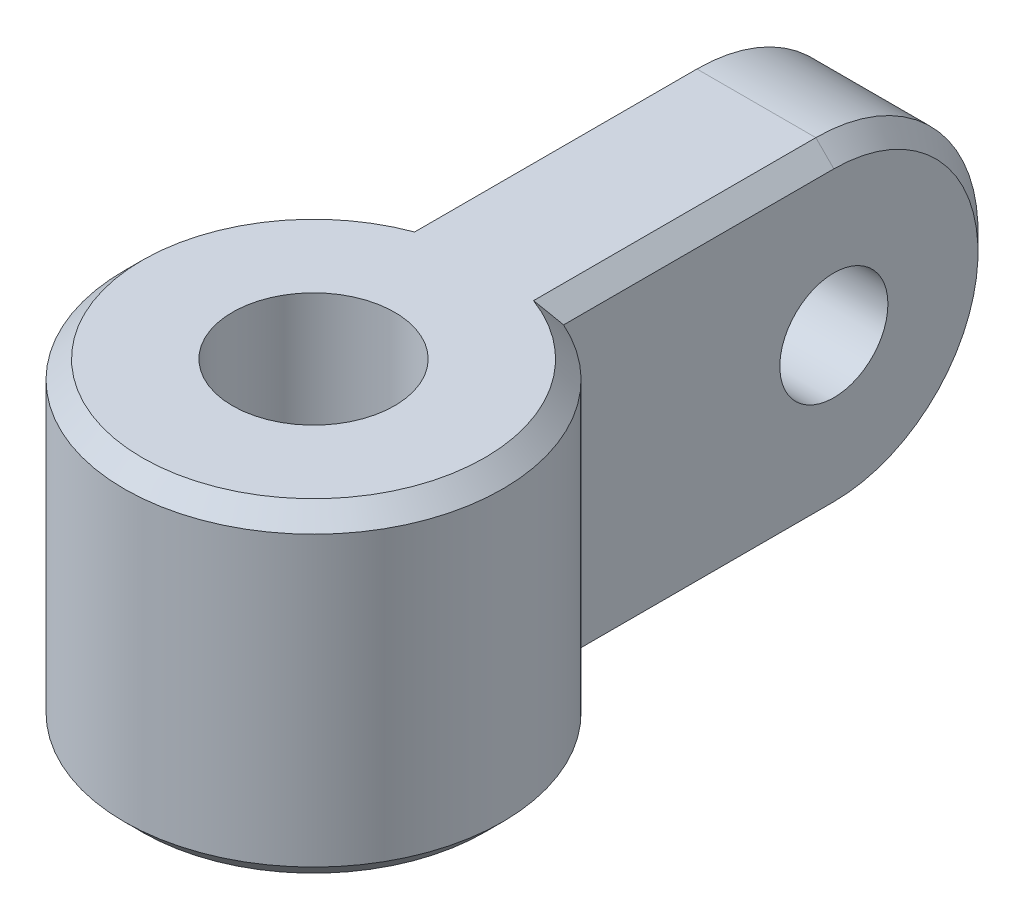
ISO-10303-21;
HEADER;
FILE_DESCRIPTION(('STEP AP214'),'2;1');
FILE_NAME('part.step','',(''),(''),'','','');
FILE_SCHEMA(('AUTOMOTIVE_DESIGN { 1 0 10303 214 1 1 1 1 }'));
ENDSEC;
DATA;
#1=APPLICATION_CONTEXT('core data for automotive mechanical design processes');
#2=APPLICATION_PROTOCOL_DEFINITION('international standard','automotive_design',2000,#1);
#3=PRODUCT_CONTEXT('',#1,'mechanical');
#4=PRODUCT('Part','Part','',(#3));
#5=PRODUCT_RELATED_PRODUCT_CATEGORY('part','',(#4));
#6=PRODUCT_DEFINITION_FORMATION('','',#4);
#7=PRODUCT_DEFINITION_CONTEXT('part definition',#1,'design');
#8=PRODUCT_DEFINITION('design','',#6,#7);
#9=PRODUCT_DEFINITION_SHAPE('','',#8);
#10=(LENGTH_UNIT() NAMED_UNIT(*) SI_UNIT(.MILLI.,.METRE.));
#11=(NAMED_UNIT(*) PLANE_ANGLE_UNIT() SI_UNIT($,.RADIAN.));
#12=(NAMED_UNIT(*) SI_UNIT($,.STERADIAN.) SOLID_ANGLE_UNIT());
#13=UNCERTAINTY_MEASURE_WITH_UNIT(LENGTH_MEASURE(1.E-05),#10,'distance_accuracy_value','');
#14=(GEOMETRIC_REPRESENTATION_CONTEXT(3) GLOBAL_UNCERTAINTY_ASSIGNED_CONTEXT((#13)) GLOBAL_UNIT_ASSIGNED_CONTEXT((#10,
#11,#12)) REPRESENTATION_CONTEXT('',''));
#15=CARTESIAN_POINT('',(0.,0.,0.));
#16=DIRECTION('',(0.,0.,1.));
#17=DIRECTION('',(1.,0.,0.));
#18=AXIS2_PLACEMENT_3D('',#15,#16,#17);
#19=CARTESIAN_POINT('',(0.,9.,0.));
#20=DIRECTION('',(0.,-1.,0.));
#21=DIRECTION('',(0.,0.,-1.));
#22=AXIS2_PLACEMENT_3D('',#19,#20,#21);
#23=CYLINDRICAL_SURFACE('',#22,5.25);
#24=DIRECTION('',(0.,-1.,0.));
#25=VECTOR('',#24,1.);
#26=CARTESIAN_POINT('',(-2.15,9.,-4.78957200593122));
#27=LINE('',#26,#25);
#28=CARTESIAN_POINT('',(-2.15,8.49999999999999,-4.78957200593122));
#29=VERTEX_POINT('',#28);
#30=CARTESIAN_POINT('',(-2.15,0.500000000000006,-4.78957200593122));
#31=VERTEX_POINT('',#30);
#32=EDGE_CURVE('E141',#29,#31,#27,.T.);
#33=ORIENTED_EDGE('',*,*,#32,.T.);
#34=CARTESIAN_POINT('',(0.,0.500000000000002,0.));
#35=DIRECTION('',(0.,1.,0.));
#36=DIRECTION('',(0.,0.,1.));
#37=AXIS2_PLACEMENT_3D('',#34,#35,#36);
#38=CIRCLE('',#37,5.25);
#39=CARTESIAN_POINT('',(2.15,0.500000000000006,-4.78957200593122));
#40=VERTEX_POINT('',#39);
#41=EDGE_CURVE('E139',#31,#40,#38,.T.);
#42=ORIENTED_EDGE('',*,*,#41,.T.);
#43=DIRECTION('',(0.,-1.,0.));
#44=VECTOR('',#43,1.);
#45=CARTESIAN_POINT('',(2.15,9.,-4.78957200593122));
#46=LINE('',#45,#44);
#47=CARTESIAN_POINT('',(2.15,8.49999999999999,-4.78957200593122));
#48=VERTEX_POINT('',#47);
#49=EDGE_CURVE('E122',#48,#40,#46,.T.);
#50=ORIENTED_EDGE('',*,*,#49,.F.);
#51=CARTESIAN_POINT('',(0.,8.49999999999999,0.));
#52=DIRECTION('',(0.,1.,0.));
#53=DIRECTION('',(0.,0.,1.));
#54=AXIS2_PLACEMENT_3D('',#51,#52,#53);
#55=CIRCLE('',#54,5.25);
#56=EDGE_CURVE('E136',#48,#29,#55,.F.);
#57=ORIENTED_EDGE('',*,*,#56,.T.);
#58=EDGE_LOOP('',(#33,#42,#50,#57));
#59=FACE_BOUND('',#58,.T.);
#60=ADVANCED_FACE('F47',(#59),#23,.T.);
#61=CARTESIAN_POINT('',(2.15,9.,0.));
#62=DIRECTION('',(-1.,0.,0.));
#63=DIRECTION('',(0.,0.,1.));
#64=AXIS2_PLACEMENT_3D('',#61,#62,#63);
#65=PLANE('',#64);
#66=ORIENTED_EDGE('',*,*,#49,.T.);
#67=DIRECTION('',(0.,0.,-1.));
#68=VECTOR('',#67,1.);
#69=CARTESIAN_POINT('',(2.15,0.500000000000006,0.));
#70=LINE('',#69,#68);
#71=CARTESIAN_POINT('',(2.15,0.500000000000004,-12.2895720059312));
#72=VERTEX_POINT('',#71);
#73=EDGE_CURVE('E273',#40,#72,#70,.T.);
#74=ORIENTED_EDGE('',*,*,#73,.T.);
#75=CARTESIAN_POINT('',(2.15,4.5,-12.2895720059312));
#76=DIRECTION('',(-1.,0.,0.));
#77=DIRECTION('',(0.,0.,1.));
#78=AXIS2_PLACEMENT_3D('',#75,#76,#77);
#79=CIRCLE('',#78,3.99999999999999);
#80=CARTESIAN_POINT('',(2.15,8.49999999999999,-12.2895720059312));
#81=VERTEX_POINT('',#80);
#82=EDGE_CURVE('E124',#72,#81,#79,.F.);
#83=ORIENTED_EDGE('',*,*,#82,.T.);
#84=DIRECTION('',(0.,0.,1.));
#85=VECTOR('',#84,1.);
#86=CARTESIAN_POINT('',(2.15,8.49999999999999,-4.78957200593122));
#87=LINE('',#86,#85);
#88=EDGE_CURVE('E118',#81,#48,#87,.T.);
#89=ORIENTED_EDGE('',*,*,#88,.T.);
#90=EDGE_LOOP('',(#66,#74,#83,#89));
#91=FACE_BOUND('',#90,.T.);
#92=CARTESIAN_POINT('',(2.15,4.5,-12.2895720059312));
#93=DIRECTION('',(1.,0.,0.));
#94=DIRECTION('',(0.,0.,-1.));
#95=AXIS2_PLACEMENT_3D('',#92,#93,#94);
#96=CIRCLE('',#95,1.5);
#97=CARTESIAN_POINT('',(2.15,4.5,-13.7895720059312));
#98=VERTEX_POINT('',#97);
#99=EDGE_CURVE('E326',#98,#98,#96,.T.);
#100=ORIENTED_EDGE('',*,*,#99,.F.);
#101=EDGE_LOOP('',(#100));
#102=FACE_BOUND('',#101,.T.);
#103=ADVANCED_FACE('F120',(#91,#102),#65,.F.);
#104=CARTESIAN_POINT('',(0.,9.,0.));
#105=DIRECTION('',(0.,-1.,0.));
#106=DIRECTION('',(0.,0.,-1.));
#107=AXIS2_PLACEMENT_3D('',#104,#105,#106);
#108=CYLINDRICAL_SURFACE('',#107,2.25);
#109=CARTESIAN_POINT('',(0.,9.,0.));
#110=DIRECTION('',(0.,1.,0.));
#111=DIRECTION('',(0.,0.,1.));
#112=AXIS2_PLACEMENT_3D('',#109,#110,#111);
#113=CIRCLE('',#112,2.25);
#114=CARTESIAN_POINT('',(0.,9.,2.25));
#115=VERTEX_POINT('',#114);
#116=EDGE_CURVE('E315',#115,#115,#113,.T.);
#117=ORIENTED_EDGE('',*,*,#116,.T.);
#118=EDGE_LOOP('',(#117));
#119=FACE_BOUND('',#118,.T.);
#120=CARTESIAN_POINT('',(0.,0.,0.));
#121=DIRECTION('',(0.,1.,0.));
#122=DIRECTION('',(0.,0.,1.));
#123=AXIS2_PLACEMENT_3D('',#120,#121,#122);
#124=CIRCLE('',#123,2.25);
#125=CARTESIAN_POINT('',(0.,0.,2.25));
#126=VERTEX_POINT('',#125);
#127=EDGE_CURVE('E316',#126,#126,#124,.T.);
#128=ORIENTED_EDGE('',*,*,#127,.F.);
#129=EDGE_LOOP('',(#128));
#130=FACE_BOUND('',#129,.T.);
#131=ADVANCED_FACE('F190',(#119,#130),#108,.F.);
#132=CARTESIAN_POINT('',(-2.15,9.,0.));
#133=DIRECTION('',(-1.,0.,0.));
#134=DIRECTION('',(0.,0.,1.));
#135=AXIS2_PLACEMENT_3D('',#132,#133,#134);
#136=PLANE('',#135);
#137=CARTESIAN_POINT('',(-2.15,4.5,-12.2895720059312));
#138=DIRECTION('',(-1.,0.,0.));
#139=DIRECTION('',(0.,0.,1.));
#140=AXIS2_PLACEMENT_3D('',#137,#138,#139);
#141=CIRCLE('',#140,3.99999999999999);
#142=CARTESIAN_POINT('',(-2.15,8.49999999999999,-12.2895720059312));
#143=VERTEX_POINT('',#142);
#144=CARTESIAN_POINT('',(-2.15,0.500000000000003,-12.2895720059312));
#145=VERTEX_POINT('',#144);
#146=EDGE_CURVE('E256',#143,#145,#141,.T.);
#147=ORIENTED_EDGE('',*,*,#146,.T.);
#148=DIRECTION('',(0.,0.,1.));
#149=VECTOR('',#148,1.);
#150=CARTESIAN_POINT('',(-2.15,0.500000000000006,-4.78957200593122));
#151=LINE('',#150,#149);
#152=EDGE_CURVE('E130',#145,#31,#151,.T.);
#153=ORIENTED_EDGE('',*,*,#152,.T.);
#154=ORIENTED_EDGE('',*,*,#32,.F.);
#155=DIRECTION('',(0.,0.,-1.));
#156=VECTOR('',#155,1.);
#157=CARTESIAN_POINT('',(-2.15,8.49999999999999,0.));
#158=LINE('',#157,#156);
#159=EDGE_CURVE('E257',#29,#143,#158,.T.);
#160=ORIENTED_EDGE('',*,*,#159,.T.);
#161=EDGE_LOOP('',(#147,#153,#154,#160));
#162=FACE_BOUND('',#161,.T.);
#163=CARTESIAN_POINT('',(-2.15,4.5,-12.2895720059312));
#164=DIRECTION('',(-1.,0.,0.));
#165=DIRECTION('',(0.,0.,1.));
#166=AXIS2_PLACEMENT_3D('',#163,#164,#165);
#167=CIRCLE('',#166,1.5);
#168=CARTESIAN_POINT('',(-2.15,4.5,-10.7895720059312));
#169=VERTEX_POINT('',#168);
#170=EDGE_CURVE('E320',#169,#169,#167,.F.);
#171=ORIENTED_EDGE('',*,*,#170,.T.);
#172=EDGE_LOOP('',(#171));
#173=FACE_BOUND('',#172,.T.);
#174=ADVANCED_FACE('F196',(#162,#173),#136,.T.);
#175=CARTESIAN_POINT('',(0.,9.,0.));
#176=DIRECTION('',(0.,1.,0.));
#177=DIRECTION('',(0.,0.,1.));
#178=AXIS2_PLACEMENT_3D('',#175,#176,#177);
#179=PLANE('',#178);
#180=DIRECTION('',(1.,0.,0.));
#181=VECTOR('',#180,1.);
#182=CARTESIAN_POINT('',(-14.8779220613579,9.,-12.2895720059312));
#183=LINE('',#182,#181);
#184=CARTESIAN_POINT('',(-1.65,9.,-12.2895720059312));
#185=VERTEX_POINT('',#184);
#186=CARTESIAN_POINT('',(1.65,9.,-12.2895720059312));
#187=VERTEX_POINT('',#186);
#188=EDGE_CURVE('E157',#185,#187,#183,.T.);
#189=ORIENTED_EDGE('',*,*,#188,.F.);
#190=DIRECTION('',(0.,0.,1.));
#191=VECTOR('',#190,1.);
#192=CARTESIAN_POINT('',(-1.65,9.,0.));
#193=LINE('',#192,#191);
#194=CARTESIAN_POINT('',(-1.64999999999998,9.,-4.45421149026402));
#195=VERTEX_POINT('',#194);
#196=EDGE_CURVE('E11',#185,#195,#193,.T.);
#197=ORIENTED_EDGE('',*,*,#196,.T.);
#198=CARTESIAN_POINT('',(0.,9.,0.));
#199=DIRECTION('',(0.,1.,0.));
#200=DIRECTION('',(0.,0.,1.));
#201=AXIS2_PLACEMENT_3D('',#198,#199,#200);
#202=CIRCLE('',#201,4.75);
#203=CARTESIAN_POINT('',(1.64999999999998,9.,-4.45421149026402));
#204=VERTEX_POINT('',#203);
#205=EDGE_CURVE('E70',#195,#204,#202,.T.);
#206=ORIENTED_EDGE('',*,*,#205,.T.);
#207=DIRECTION('',(0.,0.,-1.));
#208=VECTOR('',#207,1.);
#209=CARTESIAN_POINT('',(1.65,9.,-12.2895720059312));
#210=LINE('',#209,#208);
#211=EDGE_CURVE('E63',#204,#187,#210,.T.);
#212=ORIENTED_EDGE('',*,*,#211,.T.);
#213=EDGE_LOOP('',(#189,#197,#206,#212));
#214=FACE_BOUND('',#213,.T.);
#215=ORIENTED_EDGE('',*,*,#116,.F.);
#216=EDGE_LOOP('',(#215));
#217=FACE_BOUND('',#216,.T.);
#218=ADVANCED_FACE('F285',(#214,#217),#179,.T.);
#219=CARTESIAN_POINT('',(0.,0.,0.));
#220=DIRECTION('',(0.,1.,0.));
#221=DIRECTION('',(0.,0.,1.));
#222=AXIS2_PLACEMENT_3D('',#219,#220,#221);
#223=PLANE('',#222);
#224=ORIENTED_EDGE('',*,*,#127,.T.);
#225=EDGE_LOOP('',(#224));
#226=FACE_BOUND('',#225,.T.);
#227=CARTESIAN_POINT('',(0.,0.,0.));
#228=DIRECTION('',(0.,1.,0.));
#229=DIRECTION('',(0.,0.,1.));
#230=AXIS2_PLACEMENT_3D('',#227,#228,#229);
#231=CIRCLE('',#230,4.74999999999999);
#232=CARTESIAN_POINT('',(1.65,0.,-4.45421149026402));
#233=VERTEX_POINT('',#232);
#234=CARTESIAN_POINT('',(-1.64999999999998,0.,-4.45421149026402));
#235=VERTEX_POINT('',#234);
#236=EDGE_CURVE('E265',#233,#235,#231,.F.);
#237=ORIENTED_EDGE('',*,*,#236,.T.);
#238=DIRECTION('',(0.,0.,-1.));
#239=VECTOR('',#238,1.);
#240=CARTESIAN_POINT('',(-1.65,0.,-12.2895720059312));
#241=LINE('',#240,#239);
#242=CARTESIAN_POINT('',(-1.65,0.,-12.2895720059312));
#243=VERTEX_POINT('',#242);
#244=EDGE_CURVE('E260',#235,#243,#241,.T.);
#245=ORIENTED_EDGE('',*,*,#244,.T.);
#246=DIRECTION('',(1.,0.,0.));
#247=VECTOR('',#246,1.);
#248=CARTESIAN_POINT('',(-14.8779220613579,0.,-12.2895720059312));
#249=LINE('',#248,#247);
#250=CARTESIAN_POINT('',(1.65,0.,-12.2895720059312));
#251=VERTEX_POINT('',#250);
#252=EDGE_CURVE('E292',#243,#251,#249,.T.);
#253=ORIENTED_EDGE('',*,*,#252,.T.);
#254=DIRECTION('',(0.,0.,1.));
#255=VECTOR('',#254,1.);
#256=CARTESIAN_POINT('',(1.65,0.,0.));
#257=LINE('',#256,#255);
#258=EDGE_CURVE('E303',#251,#233,#257,.T.);
#259=ORIENTED_EDGE('',*,*,#258,.T.);
#260=EDGE_LOOP('',(#237,#245,#253,#259));
#261=FACE_BOUND('',#260,.T.);
#262=ADVANCED_FACE('F340',(#226,#261),#223,.F.);
#263=CARTESIAN_POINT('',(-14.8779220613579,4.5,-12.2895720059312));
#264=DIRECTION('',(1.,0.,0.));
#265=DIRECTION('',(0.,0.,-1.));
#266=AXIS2_PLACEMENT_3D('',#263,#264,#265);
#267=CYLINDRICAL_SURFACE('',#266,4.5);
#268=ORIENTED_EDGE('',*,*,#252,.F.);
#269=CARTESIAN_POINT('',(-1.65,4.5,-12.2895720059312));
#270=DIRECTION('',(-1.,0.,0.));
#271=DIRECTION('',(0.,0.,1.));
#272=AXIS2_PLACEMENT_3D('',#269,#270,#271);
#273=CIRCLE('',#272,4.5);
#274=EDGE_CURVE('E254',#243,#185,#273,.F.);
#275=ORIENTED_EDGE('',*,*,#274,.T.);
#276=ORIENTED_EDGE('',*,*,#188,.T.);
#277=CARTESIAN_POINT('',(1.65,4.5,-12.2895720059312));
#278=DIRECTION('',(-1.,0.,0.));
#279=DIRECTION('',(0.,0.,1.));
#280=AXIS2_PLACEMENT_3D('',#277,#278,#279);
#281=CIRCLE('',#280,4.5);
#282=EDGE_CURVE('E276',#187,#251,#281,.T.);
#283=ORIENTED_EDGE('',*,*,#282,.T.);
#284=EDGE_LOOP('',(#268,#275,#276,#283));
#285=FACE_BOUND('',#284,.T.);
#286=ADVANCED_FACE('F182',(#285),#267,.T.);
#287=CARTESIAN_POINT('',(-14.8779220613579,4.5,-12.2895720059312));
#288=DIRECTION('',(1.,0.,0.));
#289=DIRECTION('',(0.,0.,-1.));
#290=AXIS2_PLACEMENT_3D('',#287,#288,#289);
#291=CYLINDRICAL_SURFACE('',#290,1.5);
#292=ORIENTED_EDGE('',*,*,#99,.T.);
#293=EDGE_LOOP('',(#292));
#294=FACE_BOUND('',#293,.T.);
#295=ORIENTED_EDGE('',*,*,#170,.F.);
#296=EDGE_LOOP('',(#295));
#297=FACE_BOUND('',#296,.T.);
#298=ADVANCED_FACE('F175',(#294,#297),#291,.F.);
#299=CARTESIAN_POINT('',(0.,9.,0.));
#300=DIRECTION('',(0.,-1.,0.));
#301=DIRECTION('',(0.,0.,-1.));
#302=AXIS2_PLACEMENT_3D('',#299,#300,#301);
#303=CONICAL_SURFACE('',#302,4.75,0.785398163397445);
#304=CARTESIAN_POINT('',(2.15,8.49999999999999,-4.78957200593122));
#305=CARTESIAN_POINT('',(2.10806546686673,8.54193453313326,-4.76243009066161));
#306=CARTESIAN_POINT('',(2.06619245962986,8.58380754037014,-4.73509774494992));
#307=CARTESIAN_POINT('',(1.982579252243,8.66742074775699,-4.68003736977925));
#308=CARTESIAN_POINT('',(1.94083904564531,8.70916095435469,-4.65230935990042));
#309=CARTESIAN_POINT('',(1.85749680601256,8.79250319398743,-4.59643999125826));
#310=CARTESIAN_POINT('',(1.81589477381192,8.83410522618807,-4.56829863000432));
#311=CARTESIAN_POINT('',(1.73283583377882,8.91716416622118,-4.51158350224382));
#312=CARTESIAN_POINT('',(1.69137893320552,8.95862106679448,-4.48300971447825));
#313=CARTESIAN_POINT('',(1.64999999999984,9.00000000000015,-4.45421149026454));
#314=B_SPLINE_CURVE_WITH_KNOTS('',3,(#304,#305,#306,#307,#308,#309,#310,#311,#312,#313),
.UNSPECIFIED.,.F.,.F.,(4,2,2,2,4),(0.,0.195660893604835,0.391312137934826,0.586964561625966,
0.782626635458717),.UNSPECIFIED.);
#315=EDGE_CURVE('E146',#204,#48,#314,.F.);
#316=ORIENTED_EDGE('',*,*,#315,.F.);
#317=ORIENTED_EDGE('',*,*,#205,.F.);
#318=CARTESIAN_POINT('',(-1.65,9.,-4.45421149026406));
#319=CARTESIAN_POINT('',(-1.69137893320557,8.95862106679443,-4.48300971447808));
#320=CARTESIAN_POINT('',(-1.73283583377883,8.91716416622117,-4.51158350224377));
#321=CARTESIAN_POINT('',(-1.8158947738119,8.83410522618809,-4.56829863000437));
#322=CARTESIAN_POINT('',(-1.85749680601255,8.79250319398744,-4.59643999125827));
#323=CARTESIAN_POINT('',(-1.94083904564531,8.70916095435469,-4.65230935990041));
#324=CARTESIAN_POINT('',(-1.982579252243,8.66742074775699,-4.68003736977924));
#325=CARTESIAN_POINT('',(-2.06619245962985,8.58380754037014,-4.73509774494992));
#326=CARTESIAN_POINT('',(-2.10806546686673,8.54193453313327,-4.76243009066162));
#327=CARTESIAN_POINT('',(-2.15,8.49999999999999,-4.78957200593122));
#328=B_SPLINE_CURVE_WITH_KNOTS('',3,(#318,#319,#320,#321,#322,#323,#324,#325,#326,#327),
.UNSPECIFIED.,.F.,.F.,(4,2,2,2,4),(0.,0.195662073832756,0.3913144975239,0.586965741853892,
0.78262663545873),.UNSPECIFIED.);
#329=EDGE_CURVE('E53',#29,#195,#328,.F.);
#330=ORIENTED_EDGE('',*,*,#329,.F.);
#331=ORIENTED_EDGE('',*,*,#56,.F.);
#332=EDGE_LOOP('',(#316,#317,#330,#331));
#333=FACE_BOUND('',#332,.T.);
#334=ADVANCED_FACE('F145',(#333),#303,.T.);
#335=CARTESIAN_POINT('',(-2.15,8.49999999999999,0.));
#336=DIRECTION('',(0.70710678118655,-0.707106781186545,0.));
#337=DIRECTION('',(0.,0.,-1.));
#338=AXIS2_PLACEMENT_3D('',#335,#336,#337);
#339=PLANE('',#338);
#340=ORIENTED_EDGE('',*,*,#329,.T.);
#341=ORIENTED_EDGE('',*,*,#196,.F.);
#342=DIRECTION('',(0.707106781186545,0.70710678118655,0.));
#343=VECTOR('',#342,1.);
#344=CARTESIAN_POINT('',(-2.15,8.49999999999999,-12.2895720059312));
#345=LINE('',#344,#343);
#346=EDGE_CURVE('E154',#143,#185,#345,.T.);
#347=ORIENTED_EDGE('',*,*,#346,.F.);
#348=ORIENTED_EDGE('',*,*,#159,.F.);
#349=EDGE_LOOP('',(#340,#341,#347,#348));
#350=FACE_BOUND('',#349,.T.);
#351=ADVANCED_FACE('F50',(#350),#339,.F.);
#352=CARTESIAN_POINT('',(1.65,9.,0.));
#353=DIRECTION('',(0.70710678118655,0.707106781186545,0.));
#354=DIRECTION('',(0.,0.,1.));
#355=AXIS2_PLACEMENT_3D('',#352,#353,#354);
#356=PLANE('',#355);
#357=ORIENTED_EDGE('',*,*,#315,.T.);
#358=ORIENTED_EDGE('',*,*,#88,.F.);
#359=DIRECTION('',(0.707106781186545,-0.70710678118655,0.));
#360=VECTOR('',#359,1.);
#361=CARTESIAN_POINT('',(1.65,9.,-12.2895720059312));
#362=LINE('',#361,#360);
#363=EDGE_CURVE('E159',#187,#81,#362,.T.);
#364=ORIENTED_EDGE('',*,*,#363,.F.);
#365=ORIENTED_EDGE('',*,*,#211,.F.);
#366=EDGE_LOOP('',(#357,#358,#364,#365));
#367=FACE_BOUND('',#366,.T.);
#368=ADVANCED_FACE('F152',(#367),#356,.T.);
#369=CARTESIAN_POINT('',(-2.15,4.5,-12.2895720059312));
#370=DIRECTION('',(1.,0.,0.));
#371=DIRECTION('',(0.,0.,-1.));
#372=AXIS2_PLACEMENT_3D('',#369,#370,#371);
#373=CONICAL_SURFACE('',#372,4.,0.785398163397454);
#374=ORIENTED_EDGE('',*,*,#346,.T.);
#375=ORIENTED_EDGE('',*,*,#274,.F.);
#376=DIRECTION('',(0.707106781186544,-0.707106781186551,0.));
#377=VECTOR('',#376,1.);
#378=CARTESIAN_POINT('',(-2.15,0.500000000000003,-12.2895720059312));
#379=LINE('',#378,#377);
#380=EDGE_CURVE('E295',#145,#243,#379,.T.);
#381=ORIENTED_EDGE('',*,*,#380,.F.);
#382=ORIENTED_EDGE('',*,*,#146,.F.);
#383=EDGE_LOOP('',(#374,#375,#381,#382));
#384=FACE_BOUND('',#383,.T.);
#385=ADVANCED_FACE('F241',(#384),#373,.T.);
#386=CARTESIAN_POINT('',(1.65,4.5,-12.2895720059312));
#387=DIRECTION('',(-1.,0.,0.));
#388=DIRECTION('',(0.,0.,1.));
#389=AXIS2_PLACEMENT_3D('',#386,#387,#388);
#390=CONICAL_SURFACE('',#389,4.5,0.785398163397454);
#391=ORIENTED_EDGE('',*,*,#363,.T.);
#392=ORIENTED_EDGE('',*,*,#82,.F.);
#393=DIRECTION('',(0.707106781186543,0.707106781186552,0.));
#394=VECTOR('',#393,1.);
#395=CARTESIAN_POINT('',(1.65,0.,-12.2895720059312));
#396=LINE('',#395,#394);
#397=EDGE_CURVE('E225',#251,#72,#396,.T.);
#398=ORIENTED_EDGE('',*,*,#397,.F.);
#399=ORIENTED_EDGE('',*,*,#282,.F.);
#400=EDGE_LOOP('',(#391,#392,#398,#399));
#401=FACE_BOUND('',#400,.T.);
#402=ADVANCED_FACE('F235',(#401),#390,.T.);
#403=CARTESIAN_POINT('',(-1.65,0.,0.));
#404=DIRECTION('',(-0.70710678118655,-0.707106781186545,0.));
#405=DIRECTION('',(0.,0.,1.));
#406=AXIS2_PLACEMENT_3D('',#403,#404,#405);
#407=PLANE('',#406);
#408=ORIENTED_EDGE('',*,*,#380,.T.);
#409=ORIENTED_EDGE('',*,*,#244,.F.);
#410=CARTESIAN_POINT('',(-1.64999999999998,0.,-4.45421149026402));
#411=CARTESIAN_POINT('',(-1.69137893320555,0.0413789332055593,-4.48300971447805));
#412=CARTESIAN_POINT('',(-1.73283583377882,0.0828358337788195,-4.51158350224376));
#413=CARTESIAN_POINT('',(-1.81589477381189,0.165894773811893,-4.56829863000436));
#414=CARTESIAN_POINT('',(-1.85749680601254,0.207496806012547,-4.59643999125827));
#415=CARTESIAN_POINT('',(-1.9408390456453,0.290839045645307,-4.65230935990041));
#416=CARTESIAN_POINT('',(-1.982579252243,0.332579252243003,-4.68003736977924));
#417=CARTESIAN_POINT('',(-2.06619245962985,0.416192459629855,-4.73509774494992));
#418=CARTESIAN_POINT('',(-2.10806546686672,0.458065466866729,-4.76243009066163));
#419=CARTESIAN_POINT('',(-2.15,0.500000000000004,-4.78957200593122));
#420=B_SPLINE_CURVE_WITH_KNOTS('',3,(#410,#411,#412,#413,#414,#415,#416,#417,#418,#419),
.UNSPECIFIED.,.F.,.F.,(4,2,2,2,4),(0.,0.195662073832763,0.391314497523916,0.586965741853914,
0.782626635458759),.UNSPECIFIED.);
#421=EDGE_CURVE('E218',#31,#235,#420,.F.);
#422=ORIENTED_EDGE('',*,*,#421,.F.);
#423=ORIENTED_EDGE('',*,*,#152,.F.);
#424=EDGE_LOOP('',(#408,#409,#422,#423));
#425=FACE_BOUND('',#424,.T.);
#426=ADVANCED_FACE('F228',(#425),#407,.T.);
#427=CARTESIAN_POINT('',(2.15,0.500000000000006,0.));
#428=DIRECTION('',(-0.70710678118655,0.707106781186545,0.));
#429=DIRECTION('',(0.,0.,-1.));
#430=AXIS2_PLACEMENT_3D('',#427,#428,#429);
#431=PLANE('',#430);
#432=ORIENTED_EDGE('',*,*,#397,.T.);
#433=ORIENTED_EDGE('',*,*,#73,.F.);
#434=CARTESIAN_POINT('',(2.15,0.500000000000006,-4.78957200593122));
#435=CARTESIAN_POINT('',(2.10806546686673,0.458065466866735,-4.76243009066161));
#436=CARTESIAN_POINT('',(2.06619245962985,0.416192459629859,-4.73509774494992));
#437=CARTESIAN_POINT('',(1.982579252243,0.332579252243002,-4.68003736977925));
#438=CARTESIAN_POINT('',(1.9408390456453,0.290839045645304,-4.65230935990042));
#439=CARTESIAN_POINT('',(1.85749680601255,0.207496806012555,-4.59643999125826));
#440=CARTESIAN_POINT('',(1.81589477381191,0.165894773811914,-4.56829863000431));
#441=CARTESIAN_POINT('',(1.73283583377881,0.0828358337788078,-4.51158350224381));
#442=CARTESIAN_POINT('',(1.6913789332055,0.0413789332055017,-4.48300971447824));
#443=CARTESIAN_POINT('',(1.64999999999983,-1.71115714582011E-13,-4.45421149026452));
#444=B_SPLINE_CURVE_WITH_KNOTS('',3,(#434,#435,#436,#437,#438,#439,#440,#441,#442,#443),
.UNSPECIFIED.,.F.,.F.,(4,2,2,2,4),(0.,0.195660893604842,0.39131213793484,0.58696456162599,
0.782626635458746),.UNSPECIFIED.);
#445=EDGE_CURVE('E212',#233,#40,#444,.F.);
#446=ORIENTED_EDGE('',*,*,#445,.F.);
#447=ORIENTED_EDGE('',*,*,#258,.F.);
#448=EDGE_LOOP('',(#432,#433,#446,#447));
#449=FACE_BOUND('',#448,.T.);
#450=ADVANCED_FACE('F206',(#449),#431,.F.);
#451=CARTESIAN_POINT('',(0.,0.500000000000002,0.));
#452=DIRECTION('',(0.,1.,0.));
#453=DIRECTION('',(0.,0.,1.));
#454=AXIS2_PLACEMENT_3D('',#451,#452,#453);
#455=CONICAL_SURFACE('',#454,5.25,0.785398163397452);
#456=ORIENTED_EDGE('',*,*,#421,.T.);
#457=ORIENTED_EDGE('',*,*,#236,.F.);
#458=ORIENTED_EDGE('',*,*,#445,.T.);
#459=ORIENTED_EDGE('',*,*,#41,.F.);
#460=EDGE_LOOP('',(#456,#457,#458,#459));
#461=FACE_BOUND('',#460,.T.);
#462=ADVANCED_FACE('F199',(#461),#455,.T.);
#463=CLOSED_SHELL('',(#60,#103,#131,#174,#218,#262,#286,#298,#334,#351,#368,#385,#402,#426,#450,#462));
#464=MANIFOLD_SOLID_BREP('B2',#463);
#465=ADVANCED_BREP_SHAPE_REPRESENTATION('',(#18,#464),#14);
#466=SHAPE_DEFINITION_REPRESENTATION(#9,#465);
ENDSEC;
END-ISO-10303-21;
